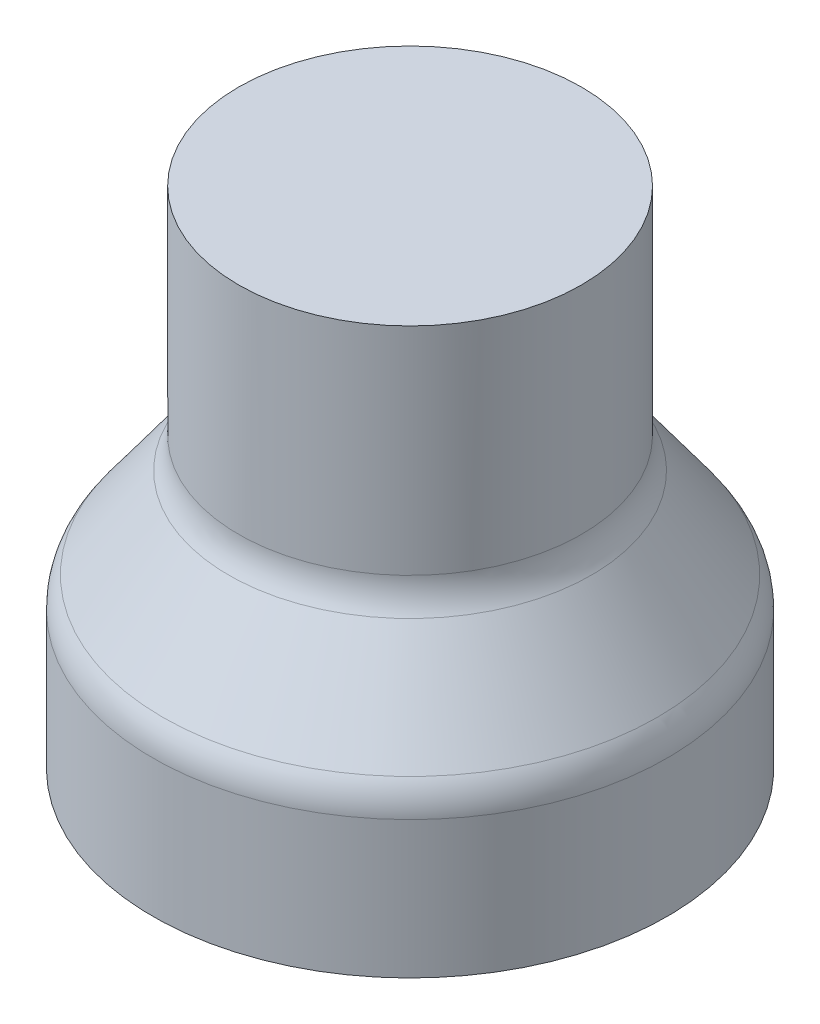
ISO-10303-21;
HEADER;
FILE_DESCRIPTION(('STEP AP214'),'2;1');
FILE_NAME('part.step','',(''),(''),'','','');
FILE_SCHEMA(('AUTOMOTIVE_DESIGN { 1 0 10303 214 1 1 1 1 }'));
ENDSEC;
DATA;
#1=APPLICATION_CONTEXT('core data for automotive mechanical design processes');
#2=APPLICATION_PROTOCOL_DEFINITION('international standard','automotive_design',2000,#1);
#3=PRODUCT_CONTEXT('',#1,'mechanical');
#4=PRODUCT('Part','Part','',(#3));
#5=PRODUCT_RELATED_PRODUCT_CATEGORY('part','',(#4));
#6=PRODUCT_DEFINITION_FORMATION('','',#4);
#7=PRODUCT_DEFINITION_CONTEXT('part definition',#1,'design');
#8=PRODUCT_DEFINITION('design','',#6,#7);
#9=PRODUCT_DEFINITION_SHAPE('','',#8);
#10=(LENGTH_UNIT() NAMED_UNIT(*) SI_UNIT(.MILLI.,.METRE.));
#11=(NAMED_UNIT(*) PLANE_ANGLE_UNIT() SI_UNIT($,.RADIAN.));
#12=(NAMED_UNIT(*) SI_UNIT($,.STERADIAN.) SOLID_ANGLE_UNIT());
#13=UNCERTAINTY_MEASURE_WITH_UNIT(LENGTH_MEASURE(1.E-05),#10,'distance_accuracy_value','');
#14=(GEOMETRIC_REPRESENTATION_CONTEXT(3) GLOBAL_UNCERTAINTY_ASSIGNED_CONTEXT((#13)) GLOBAL_UNIT_ASSIGNED_CONTEXT((#10,
#11,#12)) REPRESENTATION_CONTEXT('',''));
#15=CARTESIAN_POINT('',(0.,0.,0.));
#16=DIRECTION('',(0.,0.,1.));
#17=DIRECTION('',(1.,0.,0.));
#18=AXIS2_PLACEMENT_3D('',#15,#16,#17);
#19=CARTESIAN_POINT('',(0.,-0.227579973653746,0.));
#20=DIRECTION('',(0.,-1.,0.));
#21=DIRECTION('',(0.,0.,-1.));
#22=AXIS2_PLACEMENT_3D('',#19,#20,#21);
#23=CYLINDRICAL_SURFACE('',#22,2.);
#24=CARTESIAN_POINT('',(0.,6.2,0.));
#25=DIRECTION('',(0.,-1.,0.));
#26=DIRECTION('',(0.,0.,-1.));
#27=AXIS2_PLACEMENT_3D('',#24,#25,#26);
#28=CIRCLE('',#27,2.);
#29=CARTESIAN_POINT('',(0.,6.2,-2.));
#30=VERTEX_POINT('',#29);
#31=EDGE_CURVE('E10',#30,#30,#28,.T.);
#32=ORIENTED_EDGE('',*,*,#31,.F.);
#33=EDGE_LOOP('',(#32));
#34=FACE_BOUND('',#33,.T.);
#35=CARTESIAN_POINT('',(0.,4.2,0.));
#36=DIRECTION('',(0.,-1.,0.));
#37=DIRECTION('',(0.,0.,-1.));
#38=AXIS2_PLACEMENT_3D('',#35,#36,#37);
#39=CIRCLE('',#38,2.);
#40=CARTESIAN_POINT('',(0.,4.2,-2.));
#41=VERTEX_POINT('',#40);
#42=EDGE_CURVE('E88',#41,#41,#39,.T.);
#43=ORIENTED_EDGE('',*,*,#42,.T.);
#44=EDGE_LOOP('',(#43));
#45=FACE_BOUND('',#44,.T.);
#46=ADVANCED_FACE('F41',(#34,#45),#23,.F.);
#47=CARTESIAN_POINT('',(0.,-0.227579973653746,0.));
#48=DIRECTION('',(0.,-1.,0.));
#49=DIRECTION('',(0.,0.,-1.));
#50=AXIS2_PLACEMENT_3D('',#47,#48,#49);
#51=CYLINDRICAL_SURFACE('',#50,2.5);
#52=CARTESIAN_POINT('',(0.,4.2,0.));
#53=DIRECTION('',(0.,-1.,0.));
#54=DIRECTION('',(0.,0.,-1.));
#55=AXIS2_PLACEMENT_3D('',#52,#53,#54);
#56=CIRCLE('',#55,2.5);
#57=CARTESIAN_POINT('',(0.,4.2,-2.5));
#58=VERTEX_POINT('',#57);
#59=EDGE_CURVE('E48',#58,#58,#56,.T.);
#60=ORIENTED_EDGE('',*,*,#59,.F.);
#61=EDGE_LOOP('',(#60));
#62=FACE_BOUND('',#61,.T.);
#63=CARTESIAN_POINT('',(0.,7.35,0.));
#64=DIRECTION('',(0.,1.,0.));
#65=DIRECTION('',(0.,0.,1.));
#66=AXIS2_PLACEMENT_3D('',#63,#64,#65);
#67=CIRCLE('',#66,2.5);
#68=CARTESIAN_POINT('',(0.,7.35,2.5));
#69=VERTEX_POINT('',#68);
#70=EDGE_CURVE('E92',#69,#69,#67,.T.);
#71=ORIENTED_EDGE('',*,*,#70,.F.);
#72=EDGE_LOOP('',(#71));
#73=FACE_BOUND('',#72,.T.);
#74=ADVANCED_FACE('F99',(#62,#73),#51,.T.);
#75=CARTESIAN_POINT('',(0.,4.2,0.));
#76=DIRECTION('',(0.,-1.,0.));
#77=DIRECTION('',(0.,0.,-1.));
#78=AXIS2_PLACEMENT_3D('',#75,#76,#77);
#79=TOROIDAL_SURFACE('',#78,3.25,0.749999999999999);
#80=ORIENTED_EDGE('',*,*,#59,.T.);
#81=EDGE_LOOP('',(#80));
#82=FACE_BOUND('',#81,.T.);
#83=CARTESIAN_POINT('',(0.,3.75744453394277,0.));
#84=DIRECTION('',(0.,-1.,0.));
#85=DIRECTION('',(0.,0.,-1.));
#86=AXIS2_PLACEMENT_3D('',#83,#84,#85);
#87=CIRCLE('',#86,2.64448810130364);
#88=CARTESIAN_POINT('',(0.,3.75744453394277,-2.64448810130364));
#89=VERTEX_POINT('',#88);
#90=EDGE_CURVE('E53',#89,#89,#87,.T.);
#91=ORIENTED_EDGE('',*,*,#90,.F.);
#92=EDGE_LOOP('',(#91));
#93=FACE_BOUND('',#92,.T.);
#94=ADVANCED_FACE('F101',(#82,#93),#79,.F.);
#95=CARTESIAN_POINT('',(0.,2.44255546605723,0.));
#96=DIRECTION('',(0.,-1.,0.));
#97=DIRECTION('',(0.,0.,-1.));
#98=AXIS2_PLACEMENT_3D('',#95,#96,#97);
#99=CONICAL_SURFACE('',#98,3.60551189869636,0.631150439639797);
#100=ORIENTED_EDGE('',*,*,#90,.T.);
#101=EDGE_LOOP('',(#100));
#102=FACE_BOUND('',#101,.T.);
#103=CARTESIAN_POINT('',(0.,2.44255546605723,0.));
#104=DIRECTION('',(0.,-1.,0.));
#105=DIRECTION('',(0.,0.,-1.));
#106=AXIS2_PLACEMENT_3D('',#103,#104,#105);
#107=CIRCLE('',#106,3.60551189869636);
#108=CARTESIAN_POINT('',(0.,2.44255546605723,-3.60551189869636));
#109=VERTEX_POINT('',#108);
#110=EDGE_CURVE('E58',#109,#109,#107,.T.);
#111=ORIENTED_EDGE('',*,*,#110,.F.);
#112=EDGE_LOOP('',(#111));
#113=FACE_BOUND('',#112,.T.);
#114=ADVANCED_FACE('F107',(#102,#113),#99,.T.);
#115=CARTESIAN_POINT('',(0.,2.,0.));
#116=DIRECTION('',(0.,-1.,0.));
#117=DIRECTION('',(0.,0.,-1.));
#118=AXIS2_PLACEMENT_3D('',#115,#116,#117);
#119=TOROIDAL_SURFACE('',#118,3.,0.749999999999999);
#120=ORIENTED_EDGE('',*,*,#110,.T.);
#121=EDGE_LOOP('',(#120));
#122=FACE_BOUND('',#121,.T.);
#123=CARTESIAN_POINT('',(0.,2.,0.));
#124=DIRECTION('',(0.,-1.,0.));
#125=DIRECTION('',(0.,0.,-1.));
#126=AXIS2_PLACEMENT_3D('',#123,#124,#125);
#127=CIRCLE('',#126,3.75);
#128=CARTESIAN_POINT('',(0.,2.,-3.75));
#129=VERTEX_POINT('',#128);
#130=EDGE_CURVE('E64',#129,#129,#127,.T.);
#131=ORIENTED_EDGE('',*,*,#130,.F.);
#132=EDGE_LOOP('',(#131));
#133=FACE_BOUND('',#132,.T.);
#134=ADVANCED_FACE('F113',(#122,#133),#119,.T.);
#135=CARTESIAN_POINT('',(0.,-0.227579973653746,0.));
#136=DIRECTION('',(0.,-1.,0.));
#137=DIRECTION('',(0.,0.,-1.));
#138=AXIS2_PLACEMENT_3D('',#135,#136,#137);
#139=CYLINDRICAL_SURFACE('',#138,3.75);
#140=ORIENTED_EDGE('',*,*,#130,.T.);
#141=EDGE_LOOP('',(#140));
#142=FACE_BOUND('',#141,.T.);
#143=CARTESIAN_POINT('',(0.,0.,0.));
#144=DIRECTION('',(0.,-1.,0.));
#145=DIRECTION('',(0.,0.,-1.));
#146=AXIS2_PLACEMENT_3D('',#143,#144,#145);
#147=CIRCLE('',#146,3.75);
#148=CARTESIAN_POINT('',(0.,0.,-3.75));
#149=VERTEX_POINT('',#148);
#150=EDGE_CURVE('E68',#149,#149,#147,.T.);
#151=ORIENTED_EDGE('',*,*,#150,.F.);
#152=EDGE_LOOP('',(#151));
#153=FACE_BOUND('',#152,.T.);
#154=ADVANCED_FACE('F117',(#142,#153),#139,.T.);
#155=CARTESIAN_POINT('',(0.,0.,3.25));
#156=DIRECTION('',(0.,-1.,0.));
#157=DIRECTION('',(0.,0.,-1.));
#158=AXIS2_PLACEMENT_3D('',#155,#156,#157);
#159=PLANE('',#158);
#160=ORIENTED_EDGE('',*,*,#150,.T.);
#161=EDGE_LOOP('',(#160));
#162=FACE_BOUND('',#161,.T.);
#163=CARTESIAN_POINT('',(0.,0.,0.));
#164=DIRECTION('',(0.,-1.,0.));
#165=DIRECTION('',(0.,0.,-1.));
#166=AXIS2_PLACEMENT_3D('',#163,#164,#165);
#167=CIRCLE('',#166,3.25);
#168=CARTESIAN_POINT('',(0.,0.,-3.25));
#169=VERTEX_POINT('',#168);
#170=EDGE_CURVE('E72',#169,#169,#167,.T.);
#171=ORIENTED_EDGE('',*,*,#170,.F.);
#172=EDGE_LOOP('',(#171));
#173=FACE_BOUND('',#172,.T.);
#174=ADVANCED_FACE('F121',(#162,#173),#159,.T.);
#175=CARTESIAN_POINT('',(0.,-0.227579973653746,0.));
#176=DIRECTION('',(0.,-1.,0.));
#177=DIRECTION('',(0.,0.,-1.));
#178=AXIS2_PLACEMENT_3D('',#175,#176,#177);
#179=CYLINDRICAL_SURFACE('',#178,3.25);
#180=CARTESIAN_POINT('',(0.,2.,0.));
#181=DIRECTION('',(0.,-1.,0.));
#182=DIRECTION('',(0.,0.,-1.));
#183=AXIS2_PLACEMENT_3D('',#180,#181,#182);
#184=CIRCLE('',#183,3.25);
#185=CARTESIAN_POINT('',(0.,2.,-3.25));
#186=VERTEX_POINT('',#185);
#187=EDGE_CURVE('E76',#186,#186,#184,.T.);
#188=ORIENTED_EDGE('',*,*,#187,.F.);
#189=EDGE_LOOP('',(#188));
#190=FACE_BOUND('',#189,.T.);
#191=ORIENTED_EDGE('',*,*,#170,.T.);
#192=EDGE_LOOP('',(#191));
#193=FACE_BOUND('',#192,.T.);
#194=ADVANCED_FACE('F125',(#190,#193),#179,.F.);
#195=CARTESIAN_POINT('',(0.,2.,0.));
#196=DIRECTION('',(0.,-1.,0.));
#197=DIRECTION('',(0.,0.,-1.));
#198=AXIS2_PLACEMENT_3D('',#195,#196,#197);
#199=TOROIDAL_SURFACE('',#198,3.,0.249999999999999);
#200=CARTESIAN_POINT('',(0.,2.14751848868574,0.));
#201=DIRECTION('',(0.,-1.,0.));
#202=DIRECTION('',(0.,0.,-1.));
#203=AXIS2_PLACEMENT_3D('',#200,#201,#202);
#204=CIRCLE('',#203,3.20183729956545);
#205=CARTESIAN_POINT('',(0.,2.14751848868574,-3.20183729956545));
#206=VERTEX_POINT('',#205);
#207=EDGE_CURVE('E80',#206,#206,#204,.T.);
#208=ORIENTED_EDGE('',*,*,#207,.F.);
#209=EDGE_LOOP('',(#208));
#210=FACE_BOUND('',#209,.T.);
#211=ORIENTED_EDGE('',*,*,#187,.T.);
#212=EDGE_LOOP('',(#211));
#213=FACE_BOUND('',#212,.T.);
#214=ADVANCED_FACE('F129',(#210,#213),#199,.F.);
#215=CARTESIAN_POINT('',(0.,2.14751848868574,0.));
#216=DIRECTION('',(0.,-1.,0.));
#217=DIRECTION('',(0.,0.,-1.));
#218=AXIS2_PLACEMENT_3D('',#215,#216,#217);
#219=CONICAL_SURFACE('',#218,3.20183729956545,0.631150439639797);
#220=CARTESIAN_POINT('',(0.,3.46240755657128,0.));
#221=DIRECTION('',(0.,-1.,0.));
#222=DIRECTION('',(0.,0.,-1.));
#223=AXIS2_PLACEMENT_3D('',#220,#221,#222);
#224=CIRCLE('',#223,2.24081350217274);
#225=CARTESIAN_POINT('',(0.,3.46240755657128,-2.24081350217274));
#226=VERTEX_POINT('',#225);
#227=EDGE_CURVE('E84',#226,#226,#224,.T.);
#228=ORIENTED_EDGE('',*,*,#227,.F.);
#229=EDGE_LOOP('',(#228));
#230=FACE_BOUND('',#229,.T.);
#231=ORIENTED_EDGE('',*,*,#207,.T.);
#232=EDGE_LOOP('',(#231));
#233=FACE_BOUND('',#232,.T.);
#234=ADVANCED_FACE('F133',(#230,#233),#219,.F.);
#235=CARTESIAN_POINT('',(0.,4.2,0.));
#236=DIRECTION('',(0.,-1.,0.));
#237=DIRECTION('',(0.,0.,-1.));
#238=AXIS2_PLACEMENT_3D('',#235,#236,#237);
#239=TOROIDAL_SURFACE('',#238,3.25,1.25);
#240=ORIENTED_EDGE('',*,*,#42,.F.);
#241=EDGE_LOOP('',(#240));
#242=FACE_BOUND('',#241,.T.);
#243=ORIENTED_EDGE('',*,*,#227,.T.);
#244=EDGE_LOOP('',(#243));
#245=FACE_BOUND('',#244,.T.);
#246=ADVANCED_FACE('F137',(#242,#245),#239,.T.);
#247=CARTESIAN_POINT('',(0.,6.2,0.));
#248=DIRECTION('',(0.,1.,0.));
#249=DIRECTION('',(0.,0.,1.));
#250=AXIS2_PLACEMENT_3D('',#247,#248,#249);
#251=PLANE('',#250);
#252=ORIENTED_EDGE('',*,*,#31,.T.);
#253=EDGE_LOOP('',(#252));
#254=FACE_BOUND('',#253,.T.);
#255=ADVANCED_FACE('F141',(#254),#251,.F.);
#256=CARTESIAN_POINT('',(0.,7.35,0.));
#257=DIRECTION('',(0.,1.,0.));
#258=DIRECTION('',(0.,0.,1.));
#259=AXIS2_PLACEMENT_3D('',#256,#257,#258);
#260=PLANE('',#259);
#261=ORIENTED_EDGE('',*,*,#70,.T.);
#262=EDGE_LOOP('',(#261));
#263=FACE_BOUND('',#262,.T.);
#264=ADVANCED_FACE('F97',(#263),#260,.T.);
#265=CLOSED_SHELL('',(#46,#74,#94,#114,#134,#154,#174,#194,#214,#234,#246,#255,#264));
#266=MANIFOLD_SOLID_BREP('B2',#265);
#267=ADVANCED_BREP_SHAPE_REPRESENTATION('',(#18,#266),#14);
#268=SHAPE_DEFINITION_REPRESENTATION(#9,#267);
ENDSEC;
END-ISO-10303-21;
